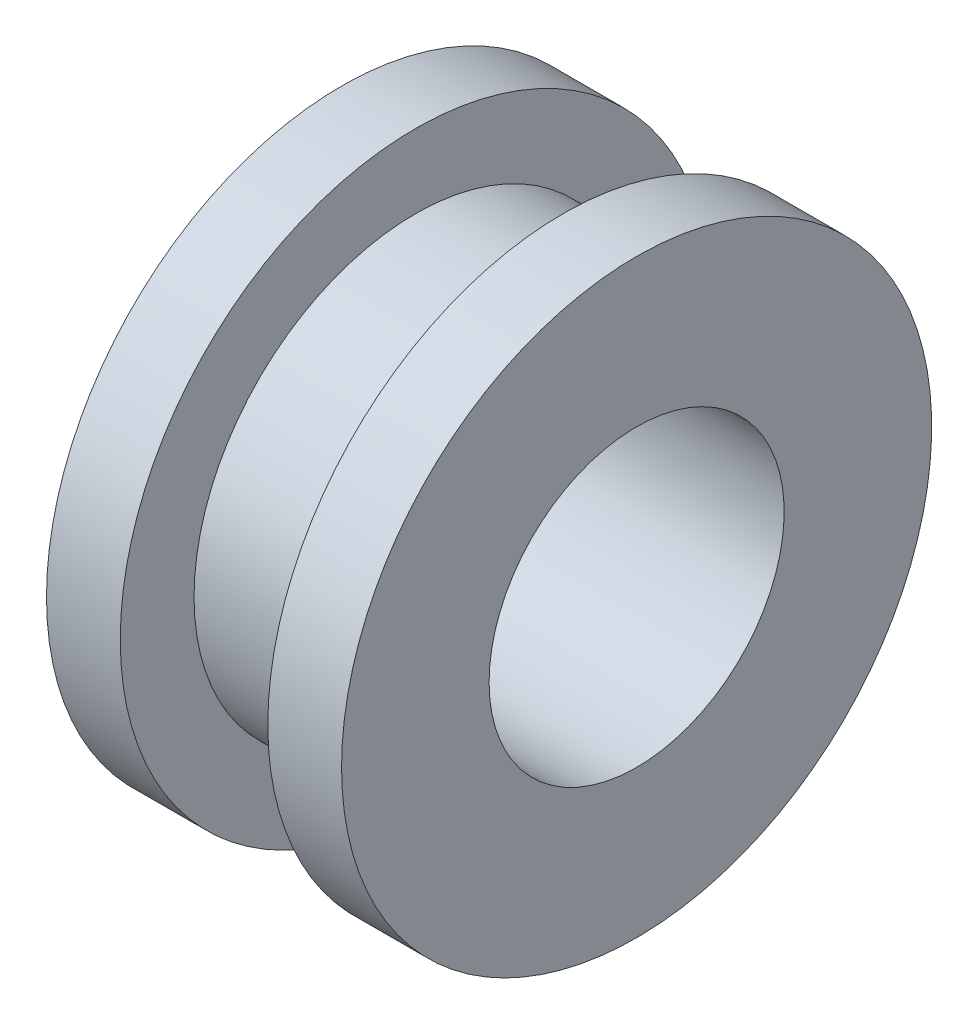
ISO-10303-21;
HEADER;
FILE_DESCRIPTION(('STEP AP214'),'2;1');
FILE_NAME('part.step','',(''),(''),'','','');
FILE_SCHEMA(('AUTOMOTIVE_DESIGN { 1 0 10303 214 1 1 1 1 }'));
ENDSEC;
DATA;
#1=APPLICATION_CONTEXT('core data for automotive mechanical design processes');
#2=APPLICATION_PROTOCOL_DEFINITION('international standard','automotive_design',2000,#1);
#3=PRODUCT_CONTEXT('',#1,'mechanical');
#4=PRODUCT('Part','Part','',(#3));
#5=PRODUCT_RELATED_PRODUCT_CATEGORY('part','',(#4));
#6=PRODUCT_DEFINITION_FORMATION('','',#4);
#7=PRODUCT_DEFINITION_CONTEXT('part definition',#1,'design');
#8=PRODUCT_DEFINITION('design','',#6,#7);
#9=PRODUCT_DEFINITION_SHAPE('','',#8);
#10=(LENGTH_UNIT() NAMED_UNIT(*) SI_UNIT(.MILLI.,.METRE.));
#11=(NAMED_UNIT(*) PLANE_ANGLE_UNIT() SI_UNIT($,.RADIAN.));
#12=(NAMED_UNIT(*) SI_UNIT($,.STERADIAN.) SOLID_ANGLE_UNIT());
#13=UNCERTAINTY_MEASURE_WITH_UNIT(LENGTH_MEASURE(1.E-05),#10,'distance_accuracy_value','');
#14=(GEOMETRIC_REPRESENTATION_CONTEXT(3) GLOBAL_UNCERTAINTY_ASSIGNED_CONTEXT((#13)) GLOBAL_UNIT_ASSIGNED_CONTEXT((#10,
#11,#12)) REPRESENTATION_CONTEXT('',''));
#15=CARTESIAN_POINT('',(0.,0.,0.));
#16=DIRECTION('',(0.,0.,1.));
#17=DIRECTION('',(1.,0.,0.));
#18=AXIS2_PLACEMENT_3D('',#15,#16,#17);
#19=CARTESIAN_POINT('',(0.5,1.5,0.));
#20=DIRECTION('',(1.,0.,0.));
#21=DIRECTION('',(0.,0.,-1.));
#22=AXIS2_PLACEMENT_3D('',#19,#20,#21);
#23=PLANE('',#22);
#24=CARTESIAN_POINT('',(0.5,0.,0.));
#25=DIRECTION('',(-1.,0.,0.));
#26=DIRECTION('',(0.,0.,1.));
#27=AXIS2_PLACEMENT_3D('',#24,#25,#26);
#28=CIRCLE('',#27,1.5);
#29=CARTESIAN_POINT('',(0.5,0.,1.5));
#30=VERTEX_POINT('',#29);
#31=EDGE_CURVE('E58',#30,#30,#28,.T.);
#32=ORIENTED_EDGE('',*,*,#31,.F.);
#33=EDGE_LOOP('',(#32));
#34=FACE_BOUND('',#33,.T.);
#35=CARTESIAN_POINT('',(0.5,0.,0.));
#36=DIRECTION('',(-1.,0.,0.));
#37=DIRECTION('',(0.,0.,1.));
#38=AXIS2_PLACEMENT_3D('',#35,#36,#37);
#39=CIRCLE('',#38,2.);
#40=CARTESIAN_POINT('',(0.5,0.,2.));
#41=VERTEX_POINT('',#40);
#42=EDGE_CURVE('E10',#41,#41,#39,.T.);
#43=ORIENTED_EDGE('',*,*,#42,.T.);
#44=EDGE_LOOP('',(#43));
#45=FACE_BOUND('',#44,.T.);
#46=ADVANCED_FACE('F30',(#34,#45),#23,.F.);
#47=CARTESIAN_POINT('',(-1.3499292118924,0.,0.));
#48=DIRECTION('',(-1.,0.,0.));
#49=DIRECTION('',(0.,0.,1.));
#50=AXIS2_PLACEMENT_3D('',#47,#48,#49);
#51=CYLINDRICAL_SURFACE('',#50,2.);
#52=ORIENTED_EDGE('',*,*,#42,.F.);
#53=EDGE_LOOP('',(#52));
#54=FACE_BOUND('',#53,.T.);
#55=CARTESIAN_POINT('',(1.,0.,0.));
#56=DIRECTION('',(-1.,0.,0.));
#57=DIRECTION('',(0.,0.,1.));
#58=AXIS2_PLACEMENT_3D('',#55,#56,#57);
#59=CIRCLE('',#58,2.);
#60=CARTESIAN_POINT('',(1.,0.,2.));
#61=VERTEX_POINT('',#60);
#62=EDGE_CURVE('E36',#61,#61,#59,.T.);
#63=ORIENTED_EDGE('',*,*,#62,.T.);
#64=EDGE_LOOP('',(#63));
#65=FACE_BOUND('',#64,.T.);
#66=ADVANCED_FACE('F65',(#54,#65),#51,.T.);
#67=CARTESIAN_POINT('',(1.,2.,0.));
#68=DIRECTION('',(-1.,0.,0.));
#69=DIRECTION('',(0.,0.,1.));
#70=AXIS2_PLACEMENT_3D('',#67,#68,#69);
#71=PLANE('',#70);
#72=ORIENTED_EDGE('',*,*,#62,.F.);
#73=EDGE_LOOP('',(#72));
#74=FACE_BOUND('',#73,.T.);
#75=CARTESIAN_POINT('',(1.,0.,0.));
#76=DIRECTION('',(-1.,0.,0.));
#77=DIRECTION('',(0.,0.,1.));
#78=AXIS2_PLACEMENT_3D('',#75,#76,#77);
#79=CIRCLE('',#78,1.);
#80=CARTESIAN_POINT('',(1.,0.,1.));
#81=VERTEX_POINT('',#80);
#82=EDGE_CURVE('E40',#81,#81,#79,.T.);
#83=ORIENTED_EDGE('',*,*,#82,.T.);
#84=EDGE_LOOP('',(#83));
#85=FACE_BOUND('',#84,.T.);
#86=ADVANCED_FACE('F69',(#74,#85),#71,.F.);
#87=CARTESIAN_POINT('',(-1.3499292118924,0.,0.));
#88=DIRECTION('',(-1.,0.,0.));
#89=DIRECTION('',(0.,0.,1.));
#90=AXIS2_PLACEMENT_3D('',#87,#88,#89);
#91=CYLINDRICAL_SURFACE('',#90,1.);
#92=ORIENTED_EDGE('',*,*,#82,.F.);
#93=EDGE_LOOP('',(#92));
#94=FACE_BOUND('',#93,.T.);
#95=CARTESIAN_POINT('',(-1.,0.,0.));
#96=DIRECTION('',(-1.,0.,0.));
#97=DIRECTION('',(0.,0.,1.));
#98=AXIS2_PLACEMENT_3D('',#95,#96,#97);
#99=CIRCLE('',#98,1.);
#100=CARTESIAN_POINT('',(-1.,0.,1.));
#101=VERTEX_POINT('',#100);
#102=EDGE_CURVE('E44',#101,#101,#99,.T.);
#103=ORIENTED_EDGE('',*,*,#102,.T.);
#104=EDGE_LOOP('',(#103));
#105=FACE_BOUND('',#104,.T.);
#106=ADVANCED_FACE('F74',(#94,#105),#91,.F.);
#107=CARTESIAN_POINT('',(-1.,2.,0.));
#108=DIRECTION('',(1.,0.,0.));
#109=DIRECTION('',(0.,0.,-1.));
#110=AXIS2_PLACEMENT_3D('',#107,#108,#109);
#111=PLANE('',#110);
#112=ORIENTED_EDGE('',*,*,#102,.F.);
#113=EDGE_LOOP('',(#112));
#114=FACE_BOUND('',#113,.T.);
#115=CARTESIAN_POINT('',(-1.,0.,0.));
#116=DIRECTION('',(-1.,0.,0.));
#117=DIRECTION('',(0.,0.,1.));
#118=AXIS2_PLACEMENT_3D('',#115,#116,#117);
#119=CIRCLE('',#118,2.);
#120=CARTESIAN_POINT('',(-1.,0.,2.));
#121=VERTEX_POINT('',#120);
#122=EDGE_CURVE('E49',#121,#121,#119,.T.);
#123=ORIENTED_EDGE('',*,*,#122,.T.);
#124=EDGE_LOOP('',(#123));
#125=FACE_BOUND('',#124,.T.);
#126=ADVANCED_FACE('F80',(#114,#125),#111,.F.);
#127=CARTESIAN_POINT('',(-1.3499292118924,0.,0.));
#128=DIRECTION('',(-1.,0.,0.));
#129=DIRECTION('',(0.,0.,1.));
#130=AXIS2_PLACEMENT_3D('',#127,#128,#129);
#131=CYLINDRICAL_SURFACE('',#130,2.);
#132=ORIENTED_EDGE('',*,*,#122,.F.);
#133=EDGE_LOOP('',(#132));
#134=FACE_BOUND('',#133,.T.);
#135=CARTESIAN_POINT('',(-0.5,0.,0.));
#136=DIRECTION('',(-1.,0.,0.));
#137=DIRECTION('',(0.,0.,1.));
#138=AXIS2_PLACEMENT_3D('',#135,#136,#137);
#139=CIRCLE('',#138,2.);
#140=CARTESIAN_POINT('',(-0.5,0.,2.));
#141=VERTEX_POINT('',#140);
#142=EDGE_CURVE('E52',#141,#141,#139,.T.);
#143=ORIENTED_EDGE('',*,*,#142,.T.);
#144=EDGE_LOOP('',(#143));
#145=FACE_BOUND('',#144,.T.);
#146=ADVANCED_FACE('F84',(#134,#145),#131,.T.);
#147=CARTESIAN_POINT('',(-0.5,1.5,0.));
#148=DIRECTION('',(-1.,0.,0.));
#149=DIRECTION('',(0.,0.,1.));
#150=AXIS2_PLACEMENT_3D('',#147,#148,#149);
#151=PLANE('',#150);
#152=ORIENTED_EDGE('',*,*,#142,.F.);
#153=EDGE_LOOP('',(#152));
#154=FACE_BOUND('',#153,.T.);
#155=CARTESIAN_POINT('',(-0.5,0.,0.));
#156=DIRECTION('',(-1.,0.,0.));
#157=DIRECTION('',(0.,0.,1.));
#158=AXIS2_PLACEMENT_3D('',#155,#156,#157);
#159=CIRCLE('',#158,1.5);
#160=CARTESIAN_POINT('',(-0.5,0.,1.5));
#161=VERTEX_POINT('',#160);
#162=EDGE_CURVE('E55',#161,#161,#159,.T.);
#163=ORIENTED_EDGE('',*,*,#162,.T.);
#164=EDGE_LOOP('',(#163));
#165=FACE_BOUND('',#164,.T.);
#166=ADVANCED_FACE('F88',(#154,#165),#151,.F.);
#167=CARTESIAN_POINT('',(-1.3499292118924,0.,0.));
#168=DIRECTION('',(-1.,0.,0.));
#169=DIRECTION('',(0.,0.,1.));
#170=AXIS2_PLACEMENT_3D('',#167,#168,#169);
#171=CYLINDRICAL_SURFACE('',#170,1.5);
#172=ORIENTED_EDGE('',*,*,#162,.F.);
#173=EDGE_LOOP('',(#172));
#174=FACE_BOUND('',#173,.T.);
#175=ORIENTED_EDGE('',*,*,#31,.T.);
#176=EDGE_LOOP('',(#175));
#177=FACE_BOUND('',#176,.T.);
#178=ADVANCED_FACE('F62',(#174,#177),#171,.T.);
#179=CLOSED_SHELL('',(#46,#66,#86,#106,#126,#146,#166,#178));
#180=MANIFOLD_SOLID_BREP('B2',#179);
#181=ADVANCED_BREP_SHAPE_REPRESENTATION('',(#18,#180),#14);
#182=SHAPE_DEFINITION_REPRESENTATION(#9,#181);
ENDSEC;
END-ISO-10303-21;
